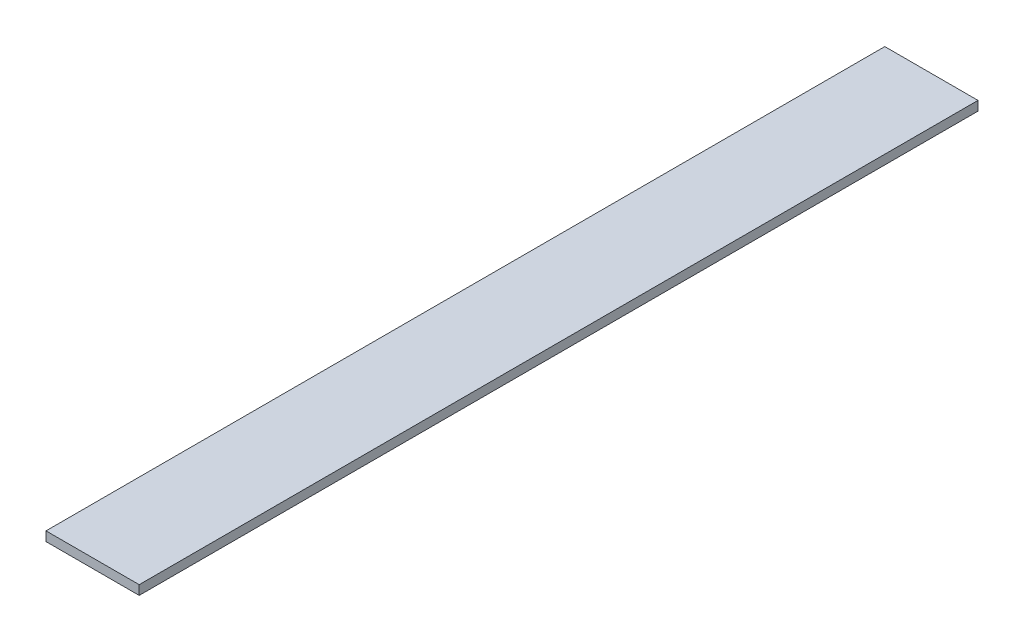
ISO-10303-21;
HEADER;
FILE_DESCRIPTION(('STEP AP214'),'2;1');
FILE_NAME('part.step','',(''),(''),'','','');
FILE_SCHEMA(('AUTOMOTIVE_DESIGN { 1 0 10303 214 1 1 1 1 }'));
ENDSEC;
DATA;
#1=APPLICATION_CONTEXT('core data for automotive mechanical design processes');
#2=APPLICATION_PROTOCOL_DEFINITION('international standard','automotive_design',2000,#1);
#3=PRODUCT_CONTEXT('',#1,'mechanical');
#4=PRODUCT('Part','Part','',(#3));
#5=PRODUCT_RELATED_PRODUCT_CATEGORY('part','',(#4));
#6=PRODUCT_DEFINITION_FORMATION('','',#4);
#7=PRODUCT_DEFINITION_CONTEXT('part definition',#1,'design');
#8=PRODUCT_DEFINITION('design','',#6,#7);
#9=PRODUCT_DEFINITION_SHAPE('','',#8);
#10=(LENGTH_UNIT() NAMED_UNIT(*) SI_UNIT(.MILLI.,.METRE.));
#11=(NAMED_UNIT(*) PLANE_ANGLE_UNIT() SI_UNIT($,.RADIAN.));
#12=(NAMED_UNIT(*) SI_UNIT($,.STERADIAN.) SOLID_ANGLE_UNIT());
#13=UNCERTAINTY_MEASURE_WITH_UNIT(LENGTH_MEASURE(1.E-05),#10,'distance_accuracy_value','');
#14=(GEOMETRIC_REPRESENTATION_CONTEXT(3) GLOBAL_UNCERTAINTY_ASSIGNED_CONTEXT((#13)) GLOBAL_UNIT_ASSIGNED_CONTEXT((#10,
#11,#12)) REPRESENTATION_CONTEXT('',''));
#15=CARTESIAN_POINT('',(0.,0.,0.));
#16=DIRECTION('',(0.,0.,1.));
#17=DIRECTION('',(1.,0.,0.));
#18=AXIS2_PLACEMENT_3D('',#15,#16,#17);
#19=CARTESIAN_POINT('',(-50.7999999999998,5.08,0.));
#20=DIRECTION('',(0.,0.,-1.));
#21=DIRECTION('',(-1.,0.,0.));
#22=AXIS2_PLACEMENT_3D('',#19,#20,#21);
#23=PLANE('',#22);
#24=DIRECTION('',(1.,0.,0.));
#25=VECTOR('',#24,1.);
#26=CARTESIAN_POINT('',(-50.7999999999998,0.,0.));
#27=LINE('',#26,#25);
#28=CARTESIAN_POINT('',(-50.7999999999998,0.,0.));
#29=VERTEX_POINT('',#28);
#30=CARTESIAN_POINT('',(0.,0.,0.));
#31=VERTEX_POINT('',#30);
#32=EDGE_CURVE('E97',#29,#31,#27,.T.);
#33=ORIENTED_EDGE('',*,*,#32,.T.);
#34=DIRECTION('',(0.,-1.,0.));
#35=VECTOR('',#34,1.);
#36=CARTESIAN_POINT('',(0.,5.08,0.));
#37=LINE('',#36,#35);
#38=CARTESIAN_POINT('',(0.,5.08,0.));
#39=VERTEX_POINT('',#38);
#40=EDGE_CURVE('E11',#39,#31,#37,.T.);
#41=ORIENTED_EDGE('',*,*,#40,.F.);
#42=DIRECTION('',(1.,0.,0.));
#43=VECTOR('',#42,1.);
#44=CARTESIAN_POINT('',(-50.7999999999998,5.08,0.));
#45=LINE('',#44,#43);
#46=CARTESIAN_POINT('',(-50.7999999999998,5.08,0.));
#47=VERTEX_POINT('',#46);
#48=EDGE_CURVE('E85',#47,#39,#45,.T.);
#49=ORIENTED_EDGE('',*,*,#48,.F.);
#50=DIRECTION('',(0.,-1.,0.));
#51=VECTOR('',#50,1.);
#52=CARTESIAN_POINT('',(-50.7999999999998,5.08,0.));
#53=LINE('',#52,#51);
#54=EDGE_CURVE('E93',#47,#29,#53,.T.);
#55=ORIENTED_EDGE('',*,*,#54,.T.);
#56=EDGE_LOOP('',(#33,#41,#49,#55));
#57=FACE_BOUND('',#56,.T.);
#58=ADVANCED_FACE('F34',(#57),#23,.F.);
#59=CARTESIAN_POINT('',(0.,5.08,0.));
#60=DIRECTION('',(-1.,0.,0.));
#61=DIRECTION('',(0.,0.,1.));
#62=AXIS2_PLACEMENT_3D('',#59,#60,#61);
#63=PLANE('',#62);
#64=DIRECTION('',(0.,0.,-1.));
#65=VECTOR('',#64,1.);
#66=CARTESIAN_POINT('',(0.,0.,0.));
#67=LINE('',#66,#65);
#68=CARTESIAN_POINT('',(0.,0.,-457.2));
#69=VERTEX_POINT('',#68);
#70=EDGE_CURVE('E89',#31,#69,#67,.T.);
#71=ORIENTED_EDGE('',*,*,#70,.T.);
#72=DIRECTION('',(0.,-1.,0.));
#73=VECTOR('',#72,1.);
#74=CARTESIAN_POINT('',(0.,5.08,-457.2));
#75=LINE('',#74,#73);
#76=CARTESIAN_POINT('',(0.,5.08,-457.2));
#77=VERTEX_POINT('',#76);
#78=EDGE_CURVE('E42',#77,#69,#75,.T.);
#79=ORIENTED_EDGE('',*,*,#78,.F.);
#80=DIRECTION('',(0.,0.,-1.));
#81=VECTOR('',#80,1.);
#82=CARTESIAN_POINT('',(0.,5.08,0.));
#83=LINE('',#82,#81);
#84=EDGE_CURVE('E80',#39,#77,#83,.T.);
#85=ORIENTED_EDGE('',*,*,#84,.F.);
#86=ORIENTED_EDGE('',*,*,#40,.T.);
#87=EDGE_LOOP('',(#71,#79,#85,#86));
#88=FACE_BOUND('',#87,.T.);
#89=ADVANCED_FACE('F88',(#88),#63,.F.);
#90=CARTESIAN_POINT('',(0.,5.08,-457.2));
#91=DIRECTION('',(0.,0.,1.));
#92=DIRECTION('',(1.,0.,0.));
#93=AXIS2_PLACEMENT_3D('',#90,#91,#92);
#94=PLANE('',#93);
#95=DIRECTION('',(-1.,0.,0.));
#96=VECTOR('',#95,1.);
#97=CARTESIAN_POINT('',(0.,0.,-457.2));
#98=LINE('',#97,#96);
#99=CARTESIAN_POINT('',(-50.8,0.,-457.2));
#100=VERTEX_POINT('',#99);
#101=EDGE_CURVE('E67',#69,#100,#98,.T.);
#102=ORIENTED_EDGE('',*,*,#101,.T.);
#103=DIRECTION('',(0.,-1.,0.));
#104=VECTOR('',#103,1.);
#105=CARTESIAN_POINT('',(-50.8,5.08,-457.2));
#106=LINE('',#105,#104);
#107=CARTESIAN_POINT('',(-50.8,5.08,-457.2));
#108=VERTEX_POINT('',#107);
#109=EDGE_CURVE('E90',#108,#100,#106,.T.);
#110=ORIENTED_EDGE('',*,*,#109,.F.);
#111=DIRECTION('',(-1.,0.,0.));
#112=VECTOR('',#111,1.);
#113=CARTESIAN_POINT('',(0.,5.08,-457.2));
#114=LINE('',#113,#112);
#115=EDGE_CURVE('E83',#77,#108,#114,.T.);
#116=ORIENTED_EDGE('',*,*,#115,.F.);
#117=ORIENTED_EDGE('',*,*,#78,.T.);
#118=EDGE_LOOP('',(#102,#110,#116,#117));
#119=FACE_BOUND('',#118,.T.);
#120=ADVANCED_FACE('F91',(#119),#94,.F.);
#121=CARTESIAN_POINT('',(-50.8,5.08,-457.2));
#122=DIRECTION('',(1.,0.,0.));
#123=DIRECTION('',(0.,0.,-1.));
#124=AXIS2_PLACEMENT_3D('',#121,#122,#123);
#125=PLANE('',#124);
#126=DIRECTION('',(0.,0.,1.));
#127=VECTOR('',#126,1.);
#128=CARTESIAN_POINT('',(-50.8,0.,-457.2));
#129=LINE('',#128,#127);
#130=EDGE_CURVE('E73',#100,#29,#129,.T.);
#131=ORIENTED_EDGE('',*,*,#130,.T.);
#132=ORIENTED_EDGE('',*,*,#54,.F.);
#133=DIRECTION('',(0.,0.,1.));
#134=VECTOR('',#133,1.);
#135=CARTESIAN_POINT('',(-50.8,5.08,-457.2));
#136=LINE('',#135,#134);
#137=EDGE_CURVE('E50',#108,#47,#136,.T.);
#138=ORIENTED_EDGE('',*,*,#137,.F.);
#139=ORIENTED_EDGE('',*,*,#109,.T.);
#140=EDGE_LOOP('',(#131,#132,#138,#139));
#141=FACE_BOUND('',#140,.T.);
#142=ADVANCED_FACE('F104',(#141),#125,.F.);
#143=CARTESIAN_POINT('',(0.,5.08,0.));
#144=DIRECTION('',(0.,1.,0.));
#145=DIRECTION('',(0.,0.,1.));
#146=AXIS2_PLACEMENT_3D('',#143,#144,#145);
#147=PLANE('',#146);
#148=ORIENTED_EDGE('',*,*,#48,.T.);
#149=ORIENTED_EDGE('',*,*,#84,.T.);
#150=ORIENTED_EDGE('',*,*,#115,.T.);
#151=ORIENTED_EDGE('',*,*,#137,.T.);
#152=EDGE_LOOP('',(#148,#149,#150,#151));
#153=FACE_BOUND('',#152,.T.);
#154=ADVANCED_FACE('F81',(#153),#147,.T.);
#155=CARTESIAN_POINT('',(0.,0.,0.));
#156=DIRECTION('',(0.,1.,0.));
#157=DIRECTION('',(0.,0.,1.));
#158=AXIS2_PLACEMENT_3D('',#155,#156,#157);
#159=PLANE('',#158);
#160=ORIENTED_EDGE('',*,*,#32,.F.);
#161=ORIENTED_EDGE('',*,*,#130,.F.);
#162=ORIENTED_EDGE('',*,*,#101,.F.);
#163=ORIENTED_EDGE('',*,*,#70,.F.);
#164=EDGE_LOOP('',(#160,#161,#162,#163));
#165=FACE_BOUND('',#164,.T.);
#166=ADVANCED_FACE('F107',(#165),#159,.F.);
#167=CLOSED_SHELL('',(#58,#89,#120,#142,#154,#166));
#168=MANIFOLD_SOLID_BREP('B2',#167);
#169=ADVANCED_BREP_SHAPE_REPRESENTATION('',(#18,#168),#14);
#170=SHAPE_DEFINITION_REPRESENTATION(#9,#169);
ENDSEC;
END-ISO-10303-21;
